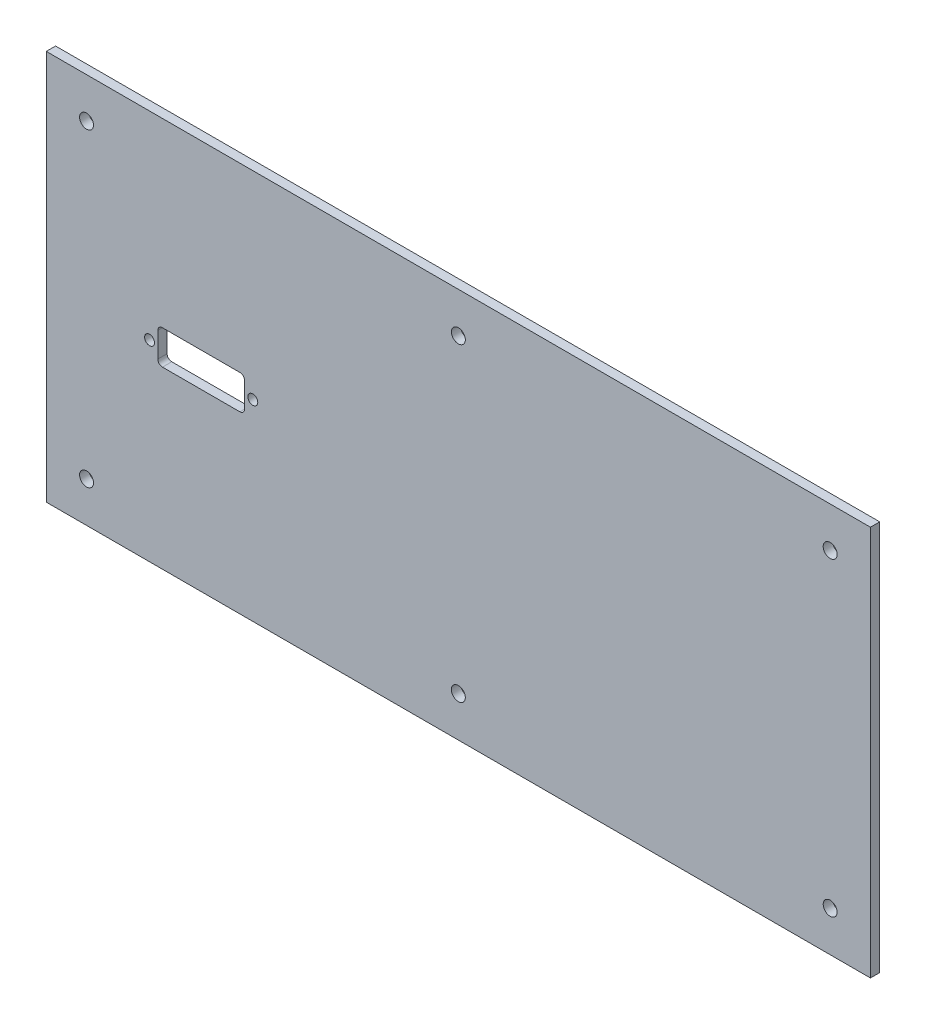
ISO-10303-21;
HEADER;
FILE_DESCRIPTION(('STEP AP214'),'2;1');
FILE_NAME('part.step','',(''),(''),'','','');
FILE_SCHEMA(('AUTOMOTIVE_DESIGN { 1 0 10303 214 1 1 1 1 }'));
ENDSEC;
DATA;
#1=APPLICATION_CONTEXT('core data for automotive mechanical design processes');
#2=APPLICATION_PROTOCOL_DEFINITION('international standard','automotive_design',2000,#1);
#3=PRODUCT_CONTEXT('',#1,'mechanical');
#4=PRODUCT('Part','Part','',(#3));
#5=PRODUCT_RELATED_PRODUCT_CATEGORY('part','',(#4));
#6=PRODUCT_DEFINITION_FORMATION('','',#4);
#7=PRODUCT_DEFINITION_CONTEXT('part definition',#1,'design');
#8=PRODUCT_DEFINITION('design','',#6,#7);
#9=PRODUCT_DEFINITION_SHAPE('','',#8);
#10=(LENGTH_UNIT() NAMED_UNIT(*) SI_UNIT(.MILLI.,.METRE.));
#11=(NAMED_UNIT(*) PLANE_ANGLE_UNIT() SI_UNIT($,.RADIAN.));
#12=(NAMED_UNIT(*) SI_UNIT($,.STERADIAN.) SOLID_ANGLE_UNIT());
#13=UNCERTAINTY_MEASURE_WITH_UNIT(LENGTH_MEASURE(1.E-05),#10,'distance_accuracy_value','');
#14=(GEOMETRIC_REPRESENTATION_CONTEXT(3) GLOBAL_UNCERTAINTY_ASSIGNED_CONTEXT((#13)) GLOBAL_UNIT_ASSIGNED_CONTEXT((#10,
#11,#12)) REPRESENTATION_CONTEXT('',''));
#15=CARTESIAN_POINT('',(0.,0.,0.));
#16=DIRECTION('',(0.,0.,1.));
#17=DIRECTION('',(1.,0.,0.));
#18=AXIS2_PLACEMENT_3D('',#15,#16,#17);
#19=CARTESIAN_POINT('',(23.,123.,239.));
#20=DIRECTION('',(0.,-1.,0.));
#21=DIRECTION('',(0.,0.,-1.));
#22=AXIS2_PLACEMENT_3D('',#19,#20,#21);
#23=PLANE('',#22);
#24=DIRECTION('',(-1.,0.,0.));
#25=VECTOR('',#24,1.);
#26=CARTESIAN_POINT('',(23.,123.,236.));
#27=LINE('',#26,#25);
#28=CARTESIAN_POINT('',(23.,123.,236.));
#29=VERTEX_POINT('',#28);
#30=CARTESIAN_POINT('',(-243.,123.,236.));
#31=VERTEX_POINT('',#30);
#32=EDGE_CURVE('E236',#29,#31,#27,.T.);
#33=ORIENTED_EDGE('',*,*,#32,.T.);
#34=DIRECTION('',(0.,0.,-1.));
#35=VECTOR('',#34,1.);
#36=CARTESIAN_POINT('',(-243.,123.,239.));
#37=LINE('',#36,#35);
#38=CARTESIAN_POINT('',(-243.,123.,239.));
#39=VERTEX_POINT('',#38);
#40=EDGE_CURVE('E11',#39,#31,#37,.T.);
#41=ORIENTED_EDGE('',*,*,#40,.F.);
#42=DIRECTION('',(-1.,0.,0.));
#43=VECTOR('',#42,1.);
#44=CARTESIAN_POINT('',(23.,123.,239.));
#45=LINE('',#44,#43);
#46=CARTESIAN_POINT('',(23.,123.,239.));
#47=VERTEX_POINT('',#46);
#48=EDGE_CURVE('E239',#47,#39,#45,.T.);
#49=ORIENTED_EDGE('',*,*,#48,.F.);
#50=DIRECTION('',(0.,0.,-1.));
#51=VECTOR('',#50,1.);
#52=CARTESIAN_POINT('',(23.,123.,239.));
#53=LINE('',#52,#51);
#54=EDGE_CURVE('E249',#47,#29,#53,.T.);
#55=ORIENTED_EDGE('',*,*,#54,.T.);
#56=EDGE_LOOP('',(#33,#41,#49,#55));
#57=FACE_BOUND('',#56,.T.);
#58=ADVANCED_FACE('F34',(#57),#23,.F.);
#59=CARTESIAN_POINT('',(-243.,123.,239.));
#60=DIRECTION('',(1.,0.,0.));
#61=DIRECTION('',(0.,1.,0.));
#62=AXIS2_PLACEMENT_3D('',#59,#60,#61);
#63=PLANE('',#62);
#64=DIRECTION('',(0.,-1.,0.));
#65=VECTOR('',#64,1.);
#66=CARTESIAN_POINT('',(-243.,123.,236.));
#67=LINE('',#66,#65);
#68=CARTESIAN_POINT('',(-243.,-2.99999999999923,236.));
#69=VERTEX_POINT('',#68);
#70=EDGE_CURVE('E252',#31,#69,#67,.T.);
#71=ORIENTED_EDGE('',*,*,#70,.T.);
#72=DIRECTION('',(0.,0.,-1.));
#73=VECTOR('',#72,1.);
#74=CARTESIAN_POINT('',(-243.,-2.99999999999923,239.));
#75=LINE('',#74,#73);
#76=CARTESIAN_POINT('',(-243.,-2.99999999999923,239.));
#77=VERTEX_POINT('',#76);
#78=EDGE_CURVE('E41',#77,#69,#75,.T.);
#79=ORIENTED_EDGE('',*,*,#78,.F.);
#80=DIRECTION('',(0.,-1.,0.));
#81=VECTOR('',#80,1.);
#82=CARTESIAN_POINT('',(-243.,123.,239.));
#83=LINE('',#82,#81);
#84=EDGE_CURVE('E242',#39,#77,#83,.T.);
#85=ORIENTED_EDGE('',*,*,#84,.F.);
#86=ORIENTED_EDGE('',*,*,#40,.T.);
#87=EDGE_LOOP('',(#71,#79,#85,#86));
#88=FACE_BOUND('',#87,.T.);
#89=ADVANCED_FACE('F281',(#88),#63,.F.);
#90=CARTESIAN_POINT('',(-243.,-2.99999999999923,239.));
#91=DIRECTION('',(0.,1.,0.));
#92=DIRECTION('',(-1.,0.,0.));
#93=AXIS2_PLACEMENT_3D('',#90,#91,#92);
#94=PLANE('',#93);
#95=DIRECTION('',(1.,0.,0.));
#96=VECTOR('',#95,1.);
#97=CARTESIAN_POINT('',(-243.,-2.99999999999923,236.));
#98=LINE('',#97,#96);
#99=CARTESIAN_POINT('',(23.,-2.99999999999886,236.));
#100=VERTEX_POINT('',#99);
#101=EDGE_CURVE('E254',#69,#100,#98,.T.);
#102=ORIENTED_EDGE('',*,*,#101,.T.);
#103=DIRECTION('',(0.,0.,-1.));
#104=VECTOR('',#103,1.);
#105=CARTESIAN_POINT('',(23.,-2.99999999999886,239.));
#106=LINE('',#105,#104);
#107=CARTESIAN_POINT('',(23.,-2.99999999999886,239.));
#108=VERTEX_POINT('',#107);
#109=EDGE_CURVE('E259',#108,#100,#106,.T.);
#110=ORIENTED_EDGE('',*,*,#109,.F.);
#111=DIRECTION('',(1.,0.,0.));
#112=VECTOR('',#111,1.);
#113=CARTESIAN_POINT('',(-243.,-2.99999999999923,239.));
#114=LINE('',#113,#112);
#115=EDGE_CURVE('E245',#77,#108,#114,.T.);
#116=ORIENTED_EDGE('',*,*,#115,.F.);
#117=ORIENTED_EDGE('',*,*,#78,.T.);
#118=EDGE_LOOP('',(#102,#110,#116,#117));
#119=FACE_BOUND('',#118,.T.);
#120=ADVANCED_FACE('F266',(#119),#94,.F.);
#121=CARTESIAN_POINT('',(23.,-2.99999999999886,239.));
#122=DIRECTION('',(-1.,0.,0.));
#123=DIRECTION('',(0.,-1.,0.));
#124=AXIS2_PLACEMENT_3D('',#121,#122,#123);
#125=PLANE('',#124);
#126=DIRECTION('',(0.,1.,0.));
#127=VECTOR('',#126,1.);
#128=CARTESIAN_POINT('',(23.,-2.99999999999886,236.));
#129=LINE('',#128,#127);
#130=EDGE_CURVE('E243',#100,#29,#129,.T.);
#131=ORIENTED_EDGE('',*,*,#130,.T.);
#132=ORIENTED_EDGE('',*,*,#54,.F.);
#133=DIRECTION('',(0.,1.,0.));
#134=VECTOR('',#133,1.);
#135=CARTESIAN_POINT('',(23.,-2.99999999999886,239.));
#136=LINE('',#135,#134);
#137=EDGE_CURVE('E247',#108,#47,#136,.T.);
#138=ORIENTED_EDGE('',*,*,#137,.F.);
#139=ORIENTED_EDGE('',*,*,#109,.T.);
#140=EDGE_LOOP('',(#131,#132,#138,#139));
#141=FACE_BOUND('',#140,.T.);
#142=ADVANCED_FACE('F274',(#141),#125,.F.);
#143=CARTESIAN_POINT('',(0.,0.,239.));
#144=DIRECTION('',(0.,0.,1.));
#145=DIRECTION('',(1.,0.,0.));
#146=AXIS2_PLACEMENT_3D('',#143,#144,#145);
#147=PLANE('',#146);
#148=CARTESIAN_POINT('',(-180.5,55.,239.));
#149=DIRECTION('',(0.,0.,1.));
#150=DIRECTION('',(1.,0.,0.));
#151=AXIS2_PLACEMENT_3D('',#148,#149,#150);
#152=CIRCLE('',#151,1.5);
#153=CARTESIAN_POINT('',(-180.5,53.5,239.));
#154=VERTEX_POINT('',#153);
#155=CARTESIAN_POINT('',(-179.,55.,239.));
#156=VERTEX_POINT('',#155);
#157=EDGE_CURVE('E48',#154,#156,#152,.T.);
#158=ORIENTED_EDGE('',*,*,#157,.F.);
#159=DIRECTION('',(1.,0.,0.));
#160=VECTOR('',#159,1.);
#161=CARTESIAN_POINT('',(-205.5,53.5,239.));
#162=LINE('',#161,#160);
#163=CARTESIAN_POINT('',(-205.5,53.5,239.));
#164=VERTEX_POINT('',#163);
#165=EDGE_CURVE('E141',#164,#154,#162,.T.);
#166=ORIENTED_EDGE('',*,*,#165,.F.);
#167=CARTESIAN_POINT('',(-205.5,55.,239.));
#168=DIRECTION('',(0.,0.,1.));
#169=DIRECTION('',(-1.,0.,0.));
#170=AXIS2_PLACEMENT_3D('',#167,#168,#169);
#171=CIRCLE('',#170,1.5);
#172=CARTESIAN_POINT('',(-207.,55.,239.));
#173=VERTEX_POINT('',#172);
#174=EDGE_CURVE('E144',#173,#164,#171,.T.);
#175=ORIENTED_EDGE('',*,*,#174,.F.);
#176=DIRECTION('',(0.,-1.,0.));
#177=VECTOR('',#176,1.);
#178=CARTESIAN_POINT('',(-207.,63.,239.));
#179=LINE('',#178,#177);
#180=CARTESIAN_POINT('',(-207.,63.,239.));
#181=VERTEX_POINT('',#180);
#182=EDGE_CURVE('E172',#181,#173,#179,.T.);
#183=ORIENTED_EDGE('',*,*,#182,.F.);
#184=CARTESIAN_POINT('',(-205.5,63.,239.));
#185=DIRECTION('',(0.,0.,1.));
#186=DIRECTION('',(1.,0.,0.));
#187=AXIS2_PLACEMENT_3D('',#184,#185,#186);
#188=CIRCLE('',#187,1.5);
#189=CARTESIAN_POINT('',(-205.5,64.5,239.));
#190=VERTEX_POINT('',#189);
#191=EDGE_CURVE('E169',#190,#181,#188,.T.);
#192=ORIENTED_EDGE('',*,*,#191,.F.);
#193=DIRECTION('',(-1.,0.,0.));
#194=VECTOR('',#193,1.);
#195=CARTESIAN_POINT('',(-205.5,64.5,239.));
#196=LINE('',#195,#194);
#197=CARTESIAN_POINT('',(-180.5,64.5,239.));
#198=VERTEX_POINT('',#197);
#199=EDGE_CURVE('E166',#198,#190,#196,.T.);
#200=ORIENTED_EDGE('',*,*,#199,.F.);
#201=CARTESIAN_POINT('',(-180.5,63.,239.));
#202=DIRECTION('',(0.,0.,1.));
#203=DIRECTION('',(1.,0.,0.));
#204=AXIS2_PLACEMENT_3D('',#201,#202,#203);
#205=CIRCLE('',#204,1.5);
#206=CARTESIAN_POINT('',(-179.,63.,239.));
#207=VERTEX_POINT('',#206);
#208=EDGE_CURVE('E163',#207,#198,#205,.T.);
#209=ORIENTED_EDGE('',*,*,#208,.F.);
#210=DIRECTION('',(0.,1.,0.));
#211=VECTOR('',#210,1.);
#212=CARTESIAN_POINT('',(-179.,63.,239.));
#213=LINE('',#212,#211);
#214=EDGE_CURVE('E161',#156,#207,#213,.T.);
#215=ORIENTED_EDGE('',*,*,#214,.F.);
#216=EDGE_LOOP('',(#158,#166,#175,#183,#192,#200,#209,#215));
#217=FACE_BOUND('',#216,.T.);
#218=CARTESIAN_POINT('',(-176.34,59.,239.));
#219=DIRECTION('',(0.,0.,1.));
#220=DIRECTION('',(1.,0.,0.));
#221=AXIS2_PLACEMENT_3D('',#218,#219,#220);
#222=CIRCLE('',#221,1.59999999999999);
#223=CARTESIAN_POINT('',(-174.74,59.,239.));
#224=VERTEX_POINT('',#223);
#225=EDGE_CURVE('E179',#224,#224,#222,.T.);
#226=ORIENTED_EDGE('',*,*,#225,.F.);
#227=EDGE_LOOP('',(#226));
#228=FACE_BOUND('',#227,.T.);
#229=CARTESIAN_POINT('',(-209.66,59.,239.));
#230=DIRECTION('',(0.,0.,1.));
#231=DIRECTION('',(1.,0.,0.));
#232=AXIS2_PLACEMENT_3D('',#229,#230,#231);
#233=CIRCLE('',#232,1.59999999999999);
#234=CARTESIAN_POINT('',(-208.06,59.,239.));
#235=VERTEX_POINT('',#234);
#236=EDGE_CURVE('E194',#235,#235,#233,.T.);
#237=ORIENTED_EDGE('',*,*,#236,.F.);
#238=EDGE_LOOP('',(#237));
#239=FACE_BOUND('',#238,.T.);
#240=CARTESIAN_POINT('',(-230.,10.0000000000008,239.));
#241=DIRECTION('',(0.,0.,1.));
#242=DIRECTION('',(1.,0.,0.));
#243=AXIS2_PLACEMENT_3D('',#240,#241,#242);
#244=CIRCLE('',#243,2.24999999999995);
#245=CARTESIAN_POINT('',(-227.75,10.0000000000008,239.));
#246=VERTEX_POINT('',#245);
#247=EDGE_CURVE('E200',#246,#246,#244,.T.);
#248=ORIENTED_EDGE('',*,*,#247,.F.);
#249=EDGE_LOOP('',(#248));
#250=FACE_BOUND('',#249,.T.);
#251=CARTESIAN_POINT('',(-110.,10.0000000000008,239.));
#252=DIRECTION('',(0.,0.,1.));
#253=DIRECTION('',(1.,0.,0.));
#254=AXIS2_PLACEMENT_3D('',#251,#252,#253);
#255=CIRCLE('',#254,2.25000000000001);
#256=CARTESIAN_POINT('',(-107.75,10.0000000000008,239.));
#257=VERTEX_POINT('',#256);
#258=EDGE_CURVE('E206',#257,#257,#255,.T.);
#259=ORIENTED_EDGE('',*,*,#258,.F.);
#260=EDGE_LOOP('',(#259));
#261=FACE_BOUND('',#260,.T.);
#262=CARTESIAN_POINT('',(10.,10.0000000000011,239.));
#263=DIRECTION('',(0.,0.,1.));
#264=DIRECTION('',(1.,0.,0.));
#265=AXIS2_PLACEMENT_3D('',#262,#263,#264);
#266=CIRCLE('',#265,2.25);
#267=CARTESIAN_POINT('',(12.25,10.0000000000011,239.));
#268=VERTEX_POINT('',#267);
#269=EDGE_CURVE('E212',#268,#268,#266,.T.);
#270=ORIENTED_EDGE('',*,*,#269,.F.);
#271=EDGE_LOOP('',(#270));
#272=FACE_BOUND('',#271,.T.);
#273=CARTESIAN_POINT('',(9.99999999999998,110.,239.));
#274=DIRECTION('',(0.,0.,1.));
#275=DIRECTION('',(1.,0.,0.));
#276=AXIS2_PLACEMENT_3D('',#273,#274,#275);
#277=CIRCLE('',#276,2.25);
#278=CARTESIAN_POINT('',(12.25,110.,239.));
#279=VERTEX_POINT('',#278);
#280=EDGE_CURVE('E218',#279,#279,#277,.T.);
#281=ORIENTED_EDGE('',*,*,#280,.F.);
#282=EDGE_LOOP('',(#281));
#283=FACE_BOUND('',#282,.T.);
#284=CARTESIAN_POINT('',(-110.,110.,239.));
#285=DIRECTION('',(0.,0.,1.));
#286=DIRECTION('',(1.,0.,0.));
#287=AXIS2_PLACEMENT_3D('',#284,#285,#286);
#288=CIRCLE('',#287,2.25000000000001);
#289=CARTESIAN_POINT('',(-107.75,110.,239.));
#290=VERTEX_POINT('',#289);
#291=EDGE_CURVE('E224',#290,#290,#288,.T.);
#292=ORIENTED_EDGE('',*,*,#291,.F.);
#293=EDGE_LOOP('',(#292));
#294=FACE_BOUND('',#293,.T.);
#295=CARTESIAN_POINT('',(-230.,110.,239.));
#296=DIRECTION('',(0.,0.,1.));
#297=DIRECTION('',(1.,0.,0.));
#298=AXIS2_PLACEMENT_3D('',#295,#296,#297);
#299=CIRCLE('',#298,2.24999999999995);
#300=CARTESIAN_POINT('',(-227.75,110.,239.));
#301=VERTEX_POINT('',#300);
#302=EDGE_CURVE('E230',#301,#301,#299,.T.);
#303=ORIENTED_EDGE('',*,*,#302,.F.);
#304=EDGE_LOOP('',(#303));
#305=FACE_BOUND('',#304,.T.);
#306=ORIENTED_EDGE('',*,*,#48,.T.);
#307=ORIENTED_EDGE('',*,*,#84,.T.);
#308=ORIENTED_EDGE('',*,*,#115,.T.);
#309=ORIENTED_EDGE('',*,*,#137,.T.);
#310=EDGE_LOOP('',(#306,#307,#308,#309));
#311=FACE_BOUND('',#310,.T.);
#312=ADVANCED_FACE('F280',(#217,#228,#239,#250,#261,#272,#283,#294,#305,#311),#147,.T.);
#313=CARTESIAN_POINT('',(0.,0.,236.));
#314=DIRECTION('',(0.,0.,1.));
#315=DIRECTION('',(1.,0.,0.));
#316=AXIS2_PLACEMENT_3D('',#313,#314,#315);
#317=PLANE('',#316);
#318=DIRECTION('',(1.,0.,0.));
#319=VECTOR('',#318,1.);
#320=CARTESIAN_POINT('',(-205.5,53.5,236.));
#321=LINE('',#320,#319);
#322=CARTESIAN_POINT('',(-205.5,53.5,236.));
#323=VERTEX_POINT('',#322);
#324=CARTESIAN_POINT('',(-180.5,53.5,236.));
#325=VERTEX_POINT('',#324);
#326=EDGE_CURVE('E130',#323,#325,#321,.T.);
#327=ORIENTED_EDGE('',*,*,#326,.T.);
#328=CARTESIAN_POINT('',(-180.5,55.,236.));
#329=DIRECTION('',(0.,0.,1.));
#330=DIRECTION('',(1.,0.,0.));
#331=AXIS2_PLACEMENT_3D('',#328,#329,#330);
#332=CIRCLE('',#331,1.5);
#333=CARTESIAN_POINT('',(-179.,55.,236.));
#334=VERTEX_POINT('',#333);
#335=EDGE_CURVE('E124',#325,#334,#332,.T.);
#336=ORIENTED_EDGE('',*,*,#335,.T.);
#337=DIRECTION('',(0.,1.,0.));
#338=VECTOR('',#337,1.);
#339=CARTESIAN_POINT('',(-179.,63.,236.));
#340=LINE('',#339,#338);
#341=CARTESIAN_POINT('',(-179.,63.,236.));
#342=VERTEX_POINT('',#341);
#343=EDGE_CURVE('E133',#334,#342,#340,.T.);
#344=ORIENTED_EDGE('',*,*,#343,.T.);
#345=CARTESIAN_POINT('',(-180.5,63.,236.));
#346=DIRECTION('',(0.,0.,1.));
#347=DIRECTION('',(1.,0.,0.));
#348=AXIS2_PLACEMENT_3D('',#345,#346,#347);
#349=CIRCLE('',#348,1.5);
#350=CARTESIAN_POINT('',(-180.5,64.5,236.));
#351=VERTEX_POINT('',#350);
#352=EDGE_CURVE('E56',#342,#351,#349,.T.);
#353=ORIENTED_EDGE('',*,*,#352,.T.);
#354=DIRECTION('',(-1.,0.,0.));
#355=VECTOR('',#354,1.);
#356=CARTESIAN_POINT('',(-205.5,64.5,236.));
#357=LINE('',#356,#355);
#358=CARTESIAN_POINT('',(-205.5,64.5,236.));
#359=VERTEX_POINT('',#358);
#360=EDGE_CURVE('E148',#351,#359,#357,.T.);
#361=ORIENTED_EDGE('',*,*,#360,.T.);
#362=CARTESIAN_POINT('',(-205.5,63.,236.));
#363=DIRECTION('',(0.,0.,1.));
#364=DIRECTION('',(1.,0.,0.));
#365=AXIS2_PLACEMENT_3D('',#362,#363,#364);
#366=CIRCLE('',#365,1.5);
#367=CARTESIAN_POINT('',(-207.,63.,236.));
#368=VERTEX_POINT('',#367);
#369=EDGE_CURVE('E151',#359,#368,#366,.T.);
#370=ORIENTED_EDGE('',*,*,#369,.T.);
#371=DIRECTION('',(0.,-1.,0.));
#372=VECTOR('',#371,1.);
#373=CARTESIAN_POINT('',(-207.,63.,236.));
#374=LINE('',#373,#372);
#375=CARTESIAN_POINT('',(-207.,55.,236.));
#376=VERTEX_POINT('',#375);
#377=EDGE_CURVE('E154',#368,#376,#374,.T.);
#378=ORIENTED_EDGE('',*,*,#377,.T.);
#379=CARTESIAN_POINT('',(-205.5,55.,236.));
#380=DIRECTION('',(0.,0.,1.));
#381=DIRECTION('',(-1.,0.,0.));
#382=AXIS2_PLACEMENT_3D('',#379,#380,#381);
#383=CIRCLE('',#382,1.5);
#384=EDGE_CURVE('E157',#376,#323,#383,.T.);
#385=ORIENTED_EDGE('',*,*,#384,.T.);
#386=EDGE_LOOP('',(#327,#336,#344,#353,#361,#370,#378,#385));
#387=FACE_BOUND('',#386,.T.);
#388=CARTESIAN_POINT('',(-176.34,59.,236.));
#389=DIRECTION('',(0.,0.,1.));
#390=DIRECTION('',(1.,0.,0.));
#391=AXIS2_PLACEMENT_3D('',#388,#389,#390);
#392=CIRCLE('',#391,1.59999999999999);
#393=CARTESIAN_POINT('',(-174.74,59.,236.));
#394=VERTEX_POINT('',#393);
#395=EDGE_CURVE('E191',#394,#394,#392,.T.);
#396=ORIENTED_EDGE('',*,*,#395,.T.);
#397=EDGE_LOOP('',(#396));
#398=FACE_BOUND('',#397,.T.);
#399=CARTESIAN_POINT('',(-209.66,59.,236.));
#400=DIRECTION('',(0.,0.,1.));
#401=DIRECTION('',(1.,0.,0.));
#402=AXIS2_PLACEMENT_3D('',#399,#400,#401);
#403=CIRCLE('',#402,1.59999999999999);
#404=CARTESIAN_POINT('',(-208.06,59.,236.));
#405=VERTEX_POINT('',#404);
#406=EDGE_CURVE('E197',#405,#405,#403,.T.);
#407=ORIENTED_EDGE('',*,*,#406,.T.);
#408=EDGE_LOOP('',(#407));
#409=FACE_BOUND('',#408,.T.);
#410=CARTESIAN_POINT('',(-230.,10.0000000000008,236.));
#411=DIRECTION('',(0.,0.,1.));
#412=DIRECTION('',(1.,0.,0.));
#413=AXIS2_PLACEMENT_3D('',#410,#411,#412);
#414=CIRCLE('',#413,2.24999999999995);
#415=CARTESIAN_POINT('',(-227.75,10.0000000000008,236.));
#416=VERTEX_POINT('',#415);
#417=EDGE_CURVE('E203',#416,#416,#414,.T.);
#418=ORIENTED_EDGE('',*,*,#417,.T.);
#419=EDGE_LOOP('',(#418));
#420=FACE_BOUND('',#419,.T.);
#421=CARTESIAN_POINT('',(-110.,10.0000000000008,236.));
#422=DIRECTION('',(0.,0.,1.));
#423=DIRECTION('',(1.,0.,0.));
#424=AXIS2_PLACEMENT_3D('',#421,#422,#423);
#425=CIRCLE('',#424,2.25000000000001);
#426=CARTESIAN_POINT('',(-107.75,10.0000000000008,236.));
#427=VERTEX_POINT('',#426);
#428=EDGE_CURVE('E209',#427,#427,#425,.T.);
#429=ORIENTED_EDGE('',*,*,#428,.T.);
#430=EDGE_LOOP('',(#429));
#431=FACE_BOUND('',#430,.T.);
#432=CARTESIAN_POINT('',(10.,10.0000000000011,236.));
#433=DIRECTION('',(0.,0.,1.));
#434=DIRECTION('',(1.,0.,0.));
#435=AXIS2_PLACEMENT_3D('',#432,#433,#434);
#436=CIRCLE('',#435,2.25);
#437=CARTESIAN_POINT('',(12.25,10.0000000000011,236.));
#438=VERTEX_POINT('',#437);
#439=EDGE_CURVE('E215',#438,#438,#436,.T.);
#440=ORIENTED_EDGE('',*,*,#439,.T.);
#441=EDGE_LOOP('',(#440));
#442=FACE_BOUND('',#441,.T.);
#443=CARTESIAN_POINT('',(9.99999999999998,110.,236.));
#444=DIRECTION('',(0.,0.,1.));
#445=DIRECTION('',(1.,0.,0.));
#446=AXIS2_PLACEMENT_3D('',#443,#444,#445);
#447=CIRCLE('',#446,2.25);
#448=CARTESIAN_POINT('',(12.25,110.,236.));
#449=VERTEX_POINT('',#448);
#450=EDGE_CURVE('E221',#449,#449,#447,.T.);
#451=ORIENTED_EDGE('',*,*,#450,.T.);
#452=EDGE_LOOP('',(#451));
#453=FACE_BOUND('',#452,.T.);
#454=CARTESIAN_POINT('',(-110.,110.,236.));
#455=DIRECTION('',(0.,0.,1.));
#456=DIRECTION('',(1.,0.,0.));
#457=AXIS2_PLACEMENT_3D('',#454,#455,#456);
#458=CIRCLE('',#457,2.25000000000001);
#459=CARTESIAN_POINT('',(-107.75,110.,236.));
#460=VERTEX_POINT('',#459);
#461=EDGE_CURVE('E227',#460,#460,#458,.T.);
#462=ORIENTED_EDGE('',*,*,#461,.T.);
#463=EDGE_LOOP('',(#462));
#464=FACE_BOUND('',#463,.T.);
#465=CARTESIAN_POINT('',(-230.,110.,236.));
#466=DIRECTION('',(0.,0.,1.));
#467=DIRECTION('',(1.,0.,0.));
#468=AXIS2_PLACEMENT_3D('',#465,#466,#467);
#469=CIRCLE('',#468,2.24999999999995);
#470=CARTESIAN_POINT('',(-227.75,110.,236.));
#471=VERTEX_POINT('',#470);
#472=EDGE_CURVE('E233',#471,#471,#469,.T.);
#473=ORIENTED_EDGE('',*,*,#472,.T.);
#474=EDGE_LOOP('',(#473));
#475=FACE_BOUND('',#474,.T.);
#476=ORIENTED_EDGE('',*,*,#32,.F.);
#477=ORIENTED_EDGE('',*,*,#130,.F.);
#478=ORIENTED_EDGE('',*,*,#101,.F.);
#479=ORIENTED_EDGE('',*,*,#70,.F.);
#480=EDGE_LOOP('',(#476,#477,#478,#479));
#481=FACE_BOUND('',#480,.T.);
#482=ADVANCED_FACE('F137',(#387,#398,#409,#420,#431,#442,#453,#464,#475,#481),#317,.F.);
#483=CARTESIAN_POINT('',(-230.,110.,236.));
#484=DIRECTION('',(0.,0.,1.));
#485=DIRECTION('',(1.,0.,0.));
#486=AXIS2_PLACEMENT_3D('',#483,#484,#485);
#487=CYLINDRICAL_SURFACE('',#486,2.24999999999995);
#488=ORIENTED_EDGE('',*,*,#472,.F.);
#489=EDGE_LOOP('',(#488));
#490=FACE_BOUND('',#489,.T.);
#491=ORIENTED_EDGE('',*,*,#302,.T.);
#492=EDGE_LOOP('',(#491));
#493=FACE_BOUND('',#492,.T.);
#494=ADVANCED_FACE('F293',(#490,#493),#487,.F.);
#495=CARTESIAN_POINT('',(-110.,110.,236.));
#496=DIRECTION('',(0.,0.,1.));
#497=DIRECTION('',(1.,0.,0.));
#498=AXIS2_PLACEMENT_3D('',#495,#496,#497);
#499=CYLINDRICAL_SURFACE('',#498,2.25000000000001);
#500=ORIENTED_EDGE('',*,*,#461,.F.);
#501=EDGE_LOOP('',(#500));
#502=FACE_BOUND('',#501,.T.);
#503=ORIENTED_EDGE('',*,*,#291,.T.);
#504=EDGE_LOOP('',(#503));
#505=FACE_BOUND('',#504,.T.);
#506=ADVANCED_FACE('F299',(#502,#505),#499,.F.);
#507=CARTESIAN_POINT('',(9.99999999999998,110.,236.));
#508=DIRECTION('',(0.,0.,1.));
#509=DIRECTION('',(1.,0.,0.));
#510=AXIS2_PLACEMENT_3D('',#507,#508,#509);
#511=CYLINDRICAL_SURFACE('',#510,2.25);
#512=ORIENTED_EDGE('',*,*,#450,.F.);
#513=EDGE_LOOP('',(#512));
#514=FACE_BOUND('',#513,.T.);
#515=ORIENTED_EDGE('',*,*,#280,.T.);
#516=EDGE_LOOP('',(#515));
#517=FACE_BOUND('',#516,.T.);
#518=ADVANCED_FACE('F303',(#514,#517),#511,.F.);
#519=CARTESIAN_POINT('',(10.,10.0000000000011,236.));
#520=DIRECTION('',(0.,0.,1.));
#521=DIRECTION('',(1.,0.,0.));
#522=AXIS2_PLACEMENT_3D('',#519,#520,#521);
#523=CYLINDRICAL_SURFACE('',#522,2.25);
#524=ORIENTED_EDGE('',*,*,#439,.F.);
#525=EDGE_LOOP('',(#524));
#526=FACE_BOUND('',#525,.T.);
#527=ORIENTED_EDGE('',*,*,#269,.T.);
#528=EDGE_LOOP('',(#527));
#529=FACE_BOUND('',#528,.T.);
#530=ADVANCED_FACE('F307',(#526,#529),#523,.F.);
#531=CARTESIAN_POINT('',(-110.,10.0000000000008,236.));
#532=DIRECTION('',(0.,0.,1.));
#533=DIRECTION('',(1.,0.,0.));
#534=AXIS2_PLACEMENT_3D('',#531,#532,#533);
#535=CYLINDRICAL_SURFACE('',#534,2.25000000000001);
#536=ORIENTED_EDGE('',*,*,#428,.F.);
#537=EDGE_LOOP('',(#536));
#538=FACE_BOUND('',#537,.T.);
#539=ORIENTED_EDGE('',*,*,#258,.T.);
#540=EDGE_LOOP('',(#539));
#541=FACE_BOUND('',#540,.T.);
#542=ADVANCED_FACE('F311',(#538,#541),#535,.F.);
#543=CARTESIAN_POINT('',(-230.,10.0000000000008,236.));
#544=DIRECTION('',(0.,0.,1.));
#545=DIRECTION('',(1.,0.,0.));
#546=AXIS2_PLACEMENT_3D('',#543,#544,#545);
#547=CYLINDRICAL_SURFACE('',#546,2.24999999999995);
#548=ORIENTED_EDGE('',*,*,#417,.F.);
#549=EDGE_LOOP('',(#548));
#550=FACE_BOUND('',#549,.T.);
#551=ORIENTED_EDGE('',*,*,#247,.T.);
#552=EDGE_LOOP('',(#551));
#553=FACE_BOUND('',#552,.T.);
#554=ADVANCED_FACE('F315',(#550,#553),#547,.F.);
#555=CARTESIAN_POINT('',(-209.66,59.,236.));
#556=DIRECTION('',(0.,0.,1.));
#557=DIRECTION('',(1.,0.,0.));
#558=AXIS2_PLACEMENT_3D('',#555,#556,#557);
#559=CYLINDRICAL_SURFACE('',#558,1.59999999999999);
#560=ORIENTED_EDGE('',*,*,#406,.F.);
#561=EDGE_LOOP('',(#560));
#562=FACE_BOUND('',#561,.T.);
#563=ORIENTED_EDGE('',*,*,#236,.T.);
#564=EDGE_LOOP('',(#563));
#565=FACE_BOUND('',#564,.T.);
#566=ADVANCED_FACE('F319',(#562,#565),#559,.F.);
#567=CARTESIAN_POINT('',(-176.34,59.,236.));
#568=DIRECTION('',(0.,0.,1.));
#569=DIRECTION('',(1.,0.,0.));
#570=AXIS2_PLACEMENT_3D('',#567,#568,#569);
#571=CYLINDRICAL_SURFACE('',#570,1.59999999999999);
#572=ORIENTED_EDGE('',*,*,#395,.F.);
#573=EDGE_LOOP('',(#572));
#574=FACE_BOUND('',#573,.T.);
#575=ORIENTED_EDGE('',*,*,#225,.T.);
#576=EDGE_LOOP('',(#575));
#577=FACE_BOUND('',#576,.T.);
#578=ADVANCED_FACE('F323',(#574,#577),#571,.F.);
#579=CARTESIAN_POINT('',(-180.5,55.,236.));
#580=DIRECTION('',(0.,0.,1.));
#581=DIRECTION('',(1.,0.,0.));
#582=AXIS2_PLACEMENT_3D('',#579,#580,#581);
#583=CYLINDRICAL_SURFACE('',#582,1.5);
#584=ORIENTED_EDGE('',*,*,#157,.T.);
#585=DIRECTION('',(0.,0.,1.));
#586=VECTOR('',#585,1.);
#587=CARTESIAN_POINT('',(-179.,55.,236.));
#588=LINE('',#587,#586);
#589=EDGE_CURVE('E120',#334,#156,#588,.T.);
#590=ORIENTED_EDGE('',*,*,#589,.F.);
#591=ORIENTED_EDGE('',*,*,#335,.F.);
#592=DIRECTION('',(0.,0.,1.));
#593=VECTOR('',#592,1.);
#594=CARTESIAN_POINT('',(-180.5,53.5,236.));
#595=LINE('',#594,#593);
#596=EDGE_CURVE('E177',#325,#154,#595,.T.);
#597=ORIENTED_EDGE('',*,*,#596,.T.);
#598=EDGE_LOOP('',(#584,#590,#591,#597));
#599=FACE_BOUND('',#598,.T.);
#600=ADVANCED_FACE('F122',(#599),#583,.F.);
#601=CARTESIAN_POINT('',(-205.5,53.5,236.));
#602=DIRECTION('',(0.,-1.,0.));
#603=DIRECTION('',(0.,0.,-1.));
#604=AXIS2_PLACEMENT_3D('',#601,#602,#603);
#605=PLANE('',#604);
#606=ORIENTED_EDGE('',*,*,#165,.T.);
#607=ORIENTED_EDGE('',*,*,#596,.F.);
#608=ORIENTED_EDGE('',*,*,#326,.F.);
#609=DIRECTION('',(0.,0.,1.));
#610=VECTOR('',#609,1.);
#611=CARTESIAN_POINT('',(-205.5,53.5,236.));
#612=LINE('',#611,#610);
#613=EDGE_CURVE('E180',#323,#164,#612,.T.);
#614=ORIENTED_EDGE('',*,*,#613,.T.);
#615=EDGE_LOOP('',(#606,#607,#608,#614));
#616=FACE_BOUND('',#615,.T.);
#617=ADVANCED_FACE('F330',(#616),#605,.F.);
#618=CARTESIAN_POINT('',(-205.5,55.,236.));
#619=DIRECTION('',(0.,0.,1.));
#620=DIRECTION('',(1.,0.,0.));
#621=AXIS2_PLACEMENT_3D('',#618,#619,#620);
#622=CYLINDRICAL_SURFACE('',#621,1.5);
#623=ORIENTED_EDGE('',*,*,#174,.T.);
#624=ORIENTED_EDGE('',*,*,#613,.F.);
#625=ORIENTED_EDGE('',*,*,#384,.F.);
#626=DIRECTION('',(0.,0.,1.));
#627=VECTOR('',#626,1.);
#628=CARTESIAN_POINT('',(-207.,55.,236.));
#629=LINE('',#628,#627);
#630=EDGE_CURVE('E182',#376,#173,#629,.T.);
#631=ORIENTED_EDGE('',*,*,#630,.T.);
#632=EDGE_LOOP('',(#623,#624,#625,#631));
#633=FACE_BOUND('',#632,.T.);
#634=ADVANCED_FACE('F347',(#633),#622,.F.);
#635=CARTESIAN_POINT('',(-207.,63.,236.));
#636=DIRECTION('',(-1.,0.,0.));
#637=DIRECTION('',(0.,0.,1.));
#638=AXIS2_PLACEMENT_3D('',#635,#636,#637);
#639=PLANE('',#638);
#640=ORIENTED_EDGE('',*,*,#182,.T.);
#641=ORIENTED_EDGE('',*,*,#630,.F.);
#642=ORIENTED_EDGE('',*,*,#377,.F.);
#643=DIRECTION('',(0.,0.,1.));
#644=VECTOR('',#643,1.);
#645=CARTESIAN_POINT('',(-207.,63.,236.));
#646=LINE('',#645,#644);
#647=EDGE_CURVE('E184',#368,#181,#646,.T.);
#648=ORIENTED_EDGE('',*,*,#647,.T.);
#649=EDGE_LOOP('',(#640,#641,#642,#648));
#650=FACE_BOUND('',#649,.T.);
#651=ADVANCED_FACE('F343',(#650),#639,.F.);
#652=CARTESIAN_POINT('',(-205.5,63.,236.));
#653=DIRECTION('',(0.,0.,1.));
#654=DIRECTION('',(1.,0.,0.));
#655=AXIS2_PLACEMENT_3D('',#652,#653,#654);
#656=CYLINDRICAL_SURFACE('',#655,1.5);
#657=ORIENTED_EDGE('',*,*,#191,.T.);
#658=ORIENTED_EDGE('',*,*,#647,.F.);
#659=ORIENTED_EDGE('',*,*,#369,.F.);
#660=DIRECTION('',(0.,0.,1.));
#661=VECTOR('',#660,1.);
#662=CARTESIAN_POINT('',(-205.5,64.5,236.));
#663=LINE('',#662,#661);
#664=EDGE_CURVE('E186',#359,#190,#663,.T.);
#665=ORIENTED_EDGE('',*,*,#664,.T.);
#666=EDGE_LOOP('',(#657,#658,#659,#665));
#667=FACE_BOUND('',#666,.T.);
#668=ADVANCED_FACE('F339',(#667),#656,.F.);
#669=CARTESIAN_POINT('',(-205.5,64.5,236.));
#670=DIRECTION('',(0.,1.,0.));
#671=DIRECTION('',(0.,0.,1.));
#672=AXIS2_PLACEMENT_3D('',#669,#670,#671);
#673=PLANE('',#672);
#674=ORIENTED_EDGE('',*,*,#199,.T.);
#675=ORIENTED_EDGE('',*,*,#664,.F.);
#676=ORIENTED_EDGE('',*,*,#360,.F.);
#677=DIRECTION('',(0.,0.,1.));
#678=VECTOR('',#677,1.);
#679=CARTESIAN_POINT('',(-180.5,64.5,236.));
#680=LINE('',#679,#678);
#681=EDGE_CURVE('E188',#351,#198,#680,.T.);
#682=ORIENTED_EDGE('',*,*,#681,.T.);
#683=EDGE_LOOP('',(#674,#675,#676,#682));
#684=FACE_BOUND('',#683,.T.);
#685=ADVANCED_FACE('F336',(#684),#673,.F.);
#686=CARTESIAN_POINT('',(-180.5,63.,236.));
#687=DIRECTION('',(0.,0.,1.));
#688=DIRECTION('',(1.,0.,0.));
#689=AXIS2_PLACEMENT_3D('',#686,#687,#688);
#690=CYLINDRICAL_SURFACE('',#689,1.5);
#691=ORIENTED_EDGE('',*,*,#208,.T.);
#692=ORIENTED_EDGE('',*,*,#681,.F.);
#693=ORIENTED_EDGE('',*,*,#352,.F.);
#694=DIRECTION('',(0.,0.,1.));
#695=VECTOR('',#694,1.);
#696=CARTESIAN_POINT('',(-179.,63.,236.));
#697=LINE('',#696,#695);
#698=EDGE_CURVE('E129',#342,#207,#697,.T.);
#699=ORIENTED_EDGE('',*,*,#698,.T.);
#700=EDGE_LOOP('',(#691,#692,#693,#699));
#701=FACE_BOUND('',#700,.T.);
#702=ADVANCED_FACE('F333',(#701),#690,.F.);
#703=CARTESIAN_POINT('',(-179.,63.,236.));
#704=DIRECTION('',(1.,0.,0.));
#705=DIRECTION('',(0.,0.,-1.));
#706=AXIS2_PLACEMENT_3D('',#703,#704,#705);
#707=PLANE('',#706);
#708=ORIENTED_EDGE('',*,*,#214,.T.);
#709=ORIENTED_EDGE('',*,*,#698,.F.);
#710=ORIENTED_EDGE('',*,*,#343,.F.);
#711=ORIENTED_EDGE('',*,*,#589,.T.);
#712=EDGE_LOOP('',(#708,#709,#710,#711));
#713=FACE_BOUND('',#712,.T.);
#714=ADVANCED_FACE('F134',(#713),#707,.F.);
#715=CLOSED_SHELL('',(#58,#89,#120,#142,#312,#482,#494,#506,#518,#530,#542,#554,#566,#578,#600,
#617,#634,#651,#668,#685,#702,#714));
#716=MANIFOLD_SOLID_BREP('B2',#715);
#717=ADVANCED_BREP_SHAPE_REPRESENTATION('',(#18,#716),#14);
#718=SHAPE_DEFINITION_REPRESENTATION(#9,#717);
ENDSEC;
END-ISO-10303-21;
